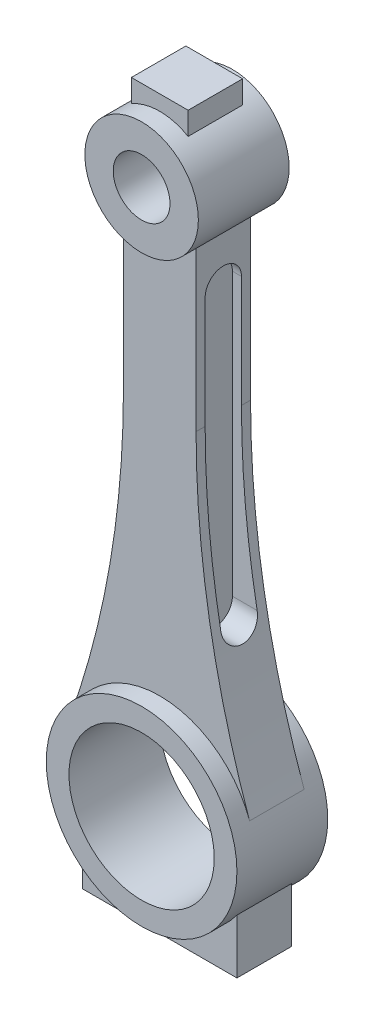
ISO-10303-21;
HEADER;
FILE_DESCRIPTION(('STEP AP214'),'2;1');
FILE_NAME('part.step','',(''),(''),'','','');
FILE_SCHEMA(('AUTOMOTIVE_DESIGN { 1 0 10303 214 1 1 1 1 }'));
ENDSEC;
DATA;
#1=APPLICATION_CONTEXT('core data for automotive mechanical design processes');
#2=APPLICATION_PROTOCOL_DEFINITION('international standard','automotive_design',2000,#1);
#3=PRODUCT_CONTEXT('',#1,'mechanical');
#4=PRODUCT('Part','Part','',(#3));
#5=PRODUCT_RELATED_PRODUCT_CATEGORY('part','',(#4));
#6=PRODUCT_DEFINITION_FORMATION('','',#4);
#7=PRODUCT_DEFINITION_CONTEXT('part definition',#1,'design');
#8=PRODUCT_DEFINITION('design','',#6,#7);
#9=PRODUCT_DEFINITION_SHAPE('','',#8);
#10=(LENGTH_UNIT() NAMED_UNIT(*) SI_UNIT(.MILLI.,.METRE.));
#11=(NAMED_UNIT(*) PLANE_ANGLE_UNIT() SI_UNIT($,.RADIAN.));
#12=(NAMED_UNIT(*) SI_UNIT($,.STERADIAN.) SOLID_ANGLE_UNIT());
#13=UNCERTAINTY_MEASURE_WITH_UNIT(LENGTH_MEASURE(1.E-05),#10,'distance_accuracy_value','');
#14=(GEOMETRIC_REPRESENTATION_CONTEXT(3) GLOBAL_UNCERTAINTY_ASSIGNED_CONTEXT((#13)) GLOBAL_UNIT_ASSIGNED_CONTEXT((#10,
#11,#12)) REPRESENTATION_CONTEXT('',''));
#15=CARTESIAN_POINT('',(0.,0.,0.));
#16=DIRECTION('',(0.,0.,1.));
#17=DIRECTION('',(1.,0.,0.));
#18=AXIS2_PLACEMENT_3D('',#15,#16,#17);
#19=CARTESIAN_POINT('',(212.132819979024,75.3953136438507,6.));
#20=DIRECTION('',(0.,0.,-1.));
#21=DIRECTION('',(-1.,0.,0.));
#22=AXIS2_PLACEMENT_3D('',#19,#20,#21);
#23=CYLINDRICAL_SURFACE('',#22,204.132819979024);
#24=CARTESIAN_POINT('',(11.4544735884215,38.,-4.00000000000001));
#25=CARTESIAN_POINT('',(11.4757515518411,37.8858086335559,-4.00000967356236));
#26=CARTESIAN_POINT('',(11.497127848932,37.7716411229782,-3.9951101211208));
#27=CARTESIAN_POINT('',(11.5399210356049,37.5441527728839,-3.97557755361704));
#28=CARTESIAN_POINT('',(11.5613379239584,37.4308319082381,-3.9609448286138));
#29=CARTESIAN_POINT('',(11.6040518019029,37.2058589467753,-3.92203609087538));
#30=CARTESIAN_POINT('',(11.6253488219803,37.0942064124742,-3.89776265395078));
#31=CARTESIAN_POINT('',(11.6676599337569,36.8733657612217,-3.83975872762631));
#32=CARTESIAN_POINT('',(11.6886740293759,36.7641776101131,-3.80602836938937));
#33=CARTESIAN_POINT('',(11.7510730473326,36.4413470108117,-3.69089420326938));
#34=CARTESIAN_POINT('',(11.7918289081029,36.2323636826891,-3.59553432969808));
#35=CARTESIAN_POINT('',(11.8702126062764,35.833491871712,-3.37027556179514));
#36=CARTESIAN_POINT('',(11.9078413597511,35.643597793309,-3.24038682968163));
#37=CARTESIAN_POINT('',(11.9784728244352,35.2894796680367,-2.950436910244));
#38=CARTESIAN_POINT('',(12.0115036519544,35.1250988255321,-2.79057453802656));
#39=CARTESIAN_POINT('',(12.0720036427705,34.8256035029566,-2.44449926104124));
#40=CARTESIAN_POINT('',(12.0994724370193,34.6904909648341,-2.25828460915734));
#41=CARTESIAN_POINT('',(12.1473413477104,34.4559602912754,-1.86832249559897));
#42=CARTESIAN_POINT('',(12.1678582991115,34.3559510460777,-1.66494499104501));
#43=CARTESIAN_POINT('',(12.201667760202,34.1915558050773,-1.24372237948288));
#44=CARTESIAN_POINT('',(12.2149615713728,34.1271633917176,-1.02587988675161));
#45=CARTESIAN_POINT('',(12.2336033492387,34.0369591960168,-0.586274812122707));
#46=CARTESIAN_POINT('',(12.2390950212482,34.0104496060439,-0.364661335561858));
#47=CARTESIAN_POINT('',(12.2423732155318,33.9946184843632,0.0799443502249368));
#48=CARTESIAN_POINT('',(12.2401601145853,34.0052951341722,0.302936491499029));
#49=CARTESIAN_POINT('',(12.2281765408432,34.0632127244266,0.74178192582431));
#50=CARTESIAN_POINT('',(12.2184766498272,34.1101121767816,0.957682365575698));
#51=CARTESIAN_POINT('',(12.1919895794175,34.2385791029979,1.37844153266758));
#52=CARTESIAN_POINT('',(12.1752023313576,34.3201469127454,1.58330015300714));
#53=CARTESIAN_POINT('',(12.1350793834177,34.5159552856904,1.977397761575));
#54=CARTESIAN_POINT('',(12.1117098081663,34.6303649264094,2.16654921549123));
#55=CARTESIAN_POINT('',(12.0593260749273,34.8882465100265,2.52297125984127));
#56=CARTESIAN_POINT('',(12.0303117725959,35.0317191961119,2.69024129055298));
#57=CARTESIAN_POINT('',(11.9671383735568,35.3461665633751,3.00114206510914));
#58=CARTESIAN_POINT('',(11.9329025496515,35.5175545383741,3.14433904981939));
#59=CARTESIAN_POINT('',(11.8607975408037,35.8812712267655,3.40006280722765));
#60=CARTESIAN_POINT('',(11.8229268395298,36.0736086840292,3.51257670427656));
#61=CARTESIAN_POINT('',(11.744011046999,36.4777513253325,3.70593438635491));
#62=CARTESIAN_POINT('',(11.7029182624971,36.6898643551292,3.78611370956408));
#63=CARTESIAN_POINT('',(11.6195357198389,37.1241795414682,3.90944320644274));
#64=CARTESIAN_POINT('',(11.5772477716993,37.3463667203578,3.95264656840454));
#65=CARTESIAN_POINT('',(11.5215540274853,37.6417241762258,3.98457340087694));
#66=CARTESIAN_POINT('',(11.5080944382149,37.713314753212,3.99036111817268));
#67=CARTESIAN_POINT('',(11.4812368188341,37.8565916807733,3.99806924003837));
#68=CARTESIAN_POINT('',(11.467838723541,37.9282776734255,3.99999606757804));
#69=CARTESIAN_POINT('',(11.4544735884215,38.,3.99999999999999));
#70=B_SPLINE_CURVE_WITH_KNOTS('',3,(#24,#25,#26,#27,#28,#29,#30,#31,#32,#33,#34,#35,#36,#37,#38,
#39,#40,#41,#42,#43,#44,#45,#46,#47,#48,#49,#50,#51,#52,#53,#54,#55,#56,#57,#58,#59,#60,#61,#62,
#63,#64,#65,#66,#67,#68,#69),.UNSPECIFIED.,.F.,.F.,(4,2,2,2,2,2,2,2,2,2,2,2,2,2,2,2,2,2,2,2,2,2,
4),(0.,0.348357600629778,0.696704820295753,1.044959030908,1.39320841164154,2.0894785742732,
2.78554404346983,3.47714614167072,4.1687941135383,4.84816302804556,5.52740949173436,
6.19397531687089,6.86050854603355,7.52083364695974,8.18116514562693,8.84495910470897,
9.50877004017901,10.1834922182609,10.8584970981523,11.546741507572,12.2339942357505,
12.4531452672714,12.6719314158043),.UNSPECIFIED.);
#71=CARTESIAN_POINT('',(11.4544735884215,38.,-4.00000000000001));
#72=VERTEX_POINT('',#71);
#73=CARTESIAN_POINT('',(11.4544735884215,38.,3.99999999999999));
#74=VERTEX_POINT('',#73);
#75=EDGE_CURVE('E481',#72,#74,#70,.T.);
#76=ORIENTED_EDGE('',*,*,#75,.T.);
#77=CARTESIAN_POINT('',(212.132819979024,75.3953136438507,3.99999999999999));
#78=DIRECTION('',(0.,0.,-1.));
#79=DIRECTION('',(0.,1.,0.));
#80=AXIS2_PLACEMENT_3D('',#77,#78,#79);
#81=CIRCLE('',#80,204.132819979024);
#82=CARTESIAN_POINT('',(7.99999999999999,75.3953136438507,4.));
#83=VERTEX_POINT('',#82);
#84=EDGE_CURVE('E279',#74,#83,#81,.T.);
#85=ORIENTED_EDGE('',*,*,#84,.T.);
#86=DIRECTION('',(0.,0.,-1.));
#87=VECTOR('',#86,1.);
#88=CARTESIAN_POINT('',(7.99999999999999,75.3953136438507,6.));
#89=LINE('',#88,#87);
#90=CARTESIAN_POINT('',(7.99999999999999,75.3953136438507,6.));
#91=VERTEX_POINT('',#90);
#92=EDGE_CURVE('E450',#91,#83,#89,.T.);
#93=ORIENTED_EDGE('',*,*,#92,.F.);
#94=CARTESIAN_POINT('',(212.132819979024,75.3953136438507,6.));
#95=DIRECTION('',(0.,0.,1.));
#96=DIRECTION('',(1.,0.,0.));
#97=AXIS2_PLACEMENT_3D('',#94,#95,#96);
#98=CIRCLE('',#97,204.132819979024);
#99=CARTESIAN_POINT('',(19.7873824881444,7.03274443356765,6.));
#100=VERTEX_POINT('',#99);
#101=EDGE_CURVE('E386',#91,#100,#98,.T.);
#102=ORIENTED_EDGE('',*,*,#101,.T.);
#103=DIRECTION('',(0.,0.,-1.));
#104=VECTOR('',#103,1.);
#105=CARTESIAN_POINT('',(19.7873824881444,7.03274443356765,6.));
#106=LINE('',#105,#104);
#107=CARTESIAN_POINT('',(19.7873824881444,7.03274443356765,-6.));
#108=VERTEX_POINT('',#107);
#109=EDGE_CURVE('E408',#100,#108,#106,.T.);
#110=ORIENTED_EDGE('',*,*,#109,.T.);
#111=CARTESIAN_POINT('',(212.132819979024,75.3953136438507,-6.));
#112=DIRECTION('',(0.,0.,1.));
#113=DIRECTION('',(1.,0.,0.));
#114=AXIS2_PLACEMENT_3D('',#111,#112,#113);
#115=CIRCLE('',#114,204.132819979024);
#116=CARTESIAN_POINT('',(7.99999999999999,75.3953136438507,-6.));
#117=VERTEX_POINT('',#116);
#118=EDGE_CURVE('E379',#117,#108,#115,.T.);
#119=ORIENTED_EDGE('',*,*,#118,.F.);
#120=CARTESIAN_POINT('',(7.99999999999999,75.3953136438507,-4.00000000000001));
#121=VERTEX_POINT('',#120);
#122=EDGE_CURVE('E449',#121,#117,#89,.T.);
#123=ORIENTED_EDGE('',*,*,#122,.F.);
#124=CARTESIAN_POINT('',(212.132819979024,75.3953136438507,-4.00000000000001));
#125=DIRECTION('',(0.,0.,-1.));
#126=DIRECTION('',(0.,1.,0.));
#127=AXIS2_PLACEMENT_3D('',#124,#125,#126);
#128=CIRCLE('',#127,204.132819979024);
#129=EDGE_CURVE('E276',#72,#121,#128,.T.);
#130=ORIENTED_EDGE('',*,*,#129,.F.);
#131=EDGE_LOOP('',(#76,#85,#93,#102,#110,#119,#123,#130));
#132=FACE_BOUND('',#131,.T.);
#133=ADVANCED_FACE('F43',(#132),#23,.F.);
#134=CARTESIAN_POINT('',(0.,0.,10.));
#135=DIRECTION('',(0.,0.,-1.));
#136=DIRECTION('',(-1.,0.,0.));
#137=AXIS2_PLACEMENT_3D('',#134,#135,#136);
#138=CYLINDRICAL_SURFACE('',#137,16.);
#139=CARTESIAN_POINT('',(0.,0.,10.));
#140=DIRECTION('',(0.,0.,1.));
#141=DIRECTION('',(1.,0.,0.));
#142=AXIS2_PLACEMENT_3D('',#139,#140,#141);
#143=CIRCLE('',#142,16.);
#144=CARTESIAN_POINT('',(16.,0.,10.));
#145=VERTEX_POINT('',#144);
#146=EDGE_CURVE('E455',#145,#145,#143,.T.);
#147=ORIENTED_EDGE('',*,*,#146,.T.);
#148=EDGE_LOOP('',(#147));
#149=FACE_BOUND('',#148,.T.);
#150=CARTESIAN_POINT('',(0.,0.,-10.));
#151=DIRECTION('',(0.,0.,1.));
#152=DIRECTION('',(1.,0.,0.));
#153=AXIS2_PLACEMENT_3D('',#150,#151,#152);
#154=CIRCLE('',#153,16.);
#155=CARTESIAN_POINT('',(16.,0.,-10.));
#156=VERTEX_POINT('',#155);
#157=EDGE_CURVE('E454',#156,#156,#154,.T.);
#158=ORIENTED_EDGE('',*,*,#157,.F.);
#159=EDGE_LOOP('',(#158));
#160=FACE_BOUND('',#159,.T.);
#161=ADVANCED_FACE('F45',(#149,#160),#138,.F.);
#162=CARTESIAN_POINT('',(0.,0.,10.));
#163=DIRECTION('',(0.,0.,-1.));
#164=DIRECTION('',(-1.,0.,0.));
#165=AXIS2_PLACEMENT_3D('',#162,#163,#164);
#166=CYLINDRICAL_SURFACE('',#165,21.);
#167=DIRECTION('',(0.,0.,-1.));
#168=VECTOR('',#167,1.);
#169=CARTESIAN_POINT('',(-17.,-12.328828005938,6.));
#170=LINE('',#169,#168);
#171=CARTESIAN_POINT('',(-17.,-12.3288280059379,6.));
#172=VERTEX_POINT('',#171);
#173=CARTESIAN_POINT('',(-17.,-12.328828005938,-6.));
#174=VERTEX_POINT('',#173);
#175=EDGE_CURVE('E321',#172,#174,#170,.T.);
#176=ORIENTED_EDGE('',*,*,#175,.F.);
#177=CARTESIAN_POINT('',(0.,0.,6.));
#178=DIRECTION('',(0.,0.,1.));
#179=DIRECTION('',(1.,0.,0.));
#180=AXIS2_PLACEMENT_3D('',#177,#178,#179);
#181=CIRCLE('',#180,21.);
#182=CARTESIAN_POINT('',(17.,-12.3288280059379,6.));
#183=VERTEX_POINT('',#182);
#184=EDGE_CURVE('E284',#172,#183,#181,.T.);
#185=ORIENTED_EDGE('',*,*,#184,.T.);
#186=DIRECTION('',(0.,0.,-1.));
#187=VECTOR('',#186,1.);
#188=CARTESIAN_POINT('',(17.,-12.3288280059379,6.));
#189=LINE('',#188,#187);
#190=CARTESIAN_POINT('',(17.,-12.3288280059379,-6.));
#191=VERTEX_POINT('',#190);
#192=EDGE_CURVE('E298',#183,#191,#189,.T.);
#193=ORIENTED_EDGE('',*,*,#192,.T.);
#194=CARTESIAN_POINT('',(0.,0.,-6.));
#195=DIRECTION('',(0.,0.,1.));
#196=DIRECTION('',(1.,0.,0.));
#197=AXIS2_PLACEMENT_3D('',#194,#195,#196);
#198=CIRCLE('',#197,21.);
#199=EDGE_CURVE('E283',#174,#191,#198,.T.);
#200=ORIENTED_EDGE('',*,*,#199,.F.);
#201=EDGE_LOOP('',(#176,#185,#193,#200));
#202=FACE_BOUND('',#201,.T.);
#203=ORIENTED_EDGE('',*,*,#109,.F.);
#204=CARTESIAN_POINT('',(0.,0.,6.));
#205=DIRECTION('',(0.,0.,1.));
#206=DIRECTION('',(1.,0.,0.));
#207=AXIS2_PLACEMENT_3D('',#204,#205,#206);
#208=CIRCLE('',#207,21.);
#209=CARTESIAN_POINT('',(-19.7873824881444,7.03274443356765,6.));
#210=VERTEX_POINT('',#209);
#211=EDGE_CURVE('E405',#100,#210,#208,.T.);
#212=ORIENTED_EDGE('',*,*,#211,.T.);
#213=DIRECTION('',(0.,0.,-1.));
#214=VECTOR('',#213,1.);
#215=CARTESIAN_POINT('',(-19.7873824881444,7.03274443356764,6.));
#216=LINE('',#215,#214);
#217=CARTESIAN_POINT('',(-19.7873824881444,7.03274443356764,-6.));
#218=VERTEX_POINT('',#217);
#219=EDGE_CURVE('E434',#210,#218,#216,.T.);
#220=ORIENTED_EDGE('',*,*,#219,.T.);
#221=CARTESIAN_POINT('',(0.,0.,-6.));
#222=DIRECTION('',(0.,0.,1.));
#223=DIRECTION('',(1.,0.,0.));
#224=AXIS2_PLACEMENT_3D('',#221,#222,#223);
#225=CIRCLE('',#224,21.);
#226=EDGE_CURVE('E391',#108,#218,#225,.T.);
#227=ORIENTED_EDGE('',*,*,#226,.F.);
#228=EDGE_LOOP('',(#203,#212,#220,#227));
#229=FACE_BOUND('',#228,.T.);
#230=CARTESIAN_POINT('',(0.,0.,10.));
#231=DIRECTION('',(0.,0.,1.));
#232=DIRECTION('',(1.,0.,0.));
#233=AXIS2_PLACEMENT_3D('',#230,#231,#232);
#234=CIRCLE('',#233,21.);
#235=CARTESIAN_POINT('',(21.,0.,10.));
#236=VERTEX_POINT('',#235);
#237=EDGE_CURVE('E459',#236,#236,#234,.T.);
#238=ORIENTED_EDGE('',*,*,#237,.F.);
#239=EDGE_LOOP('',(#238));
#240=FACE_BOUND('',#239,.T.);
#241=CARTESIAN_POINT('',(0.,0.,-10.));
#242=DIRECTION('',(0.,0.,1.));
#243=DIRECTION('',(1.,0.,0.));
#244=AXIS2_PLACEMENT_3D('',#241,#242,#243);
#245=CIRCLE('',#244,21.);
#246=CARTESIAN_POINT('',(21.,0.,-10.));
#247=VERTEX_POINT('',#246);
#248=EDGE_CURVE('E460',#247,#247,#245,.T.);
#249=ORIENTED_EDGE('',*,*,#248,.T.);
#250=EDGE_LOOP('',(#249));
#251=FACE_BOUND('',#250,.T.);
#252=ADVANCED_FACE('F600',(#202,#229,#240,#251),#166,.T.);
#253=CARTESIAN_POINT('',(0.,0.,10.));
#254=DIRECTION('',(0.,0.,1.));
#255=DIRECTION('',(1.,0.,0.));
#256=AXIS2_PLACEMENT_3D('',#253,#254,#255);
#257=PLANE('',#256);
#258=ORIENTED_EDGE('',*,*,#146,.F.);
#259=EDGE_LOOP('',(#258));
#260=FACE_BOUND('',#259,.T.);
#261=ORIENTED_EDGE('',*,*,#237,.T.);
#262=EDGE_LOOP('',(#261));
#263=FACE_BOUND('',#262,.T.);
#264=ADVANCED_FACE('F592',(#260,#263),#257,.T.);
#265=CARTESIAN_POINT('',(0.,0.,-10.));
#266=DIRECTION('',(0.,0.,1.));
#267=DIRECTION('',(1.,0.,0.));
#268=AXIS2_PLACEMENT_3D('',#265,#266,#267);
#269=PLANE('',#268);
#270=ORIENTED_EDGE('',*,*,#157,.T.);
#271=EDGE_LOOP('',(#270));
#272=FACE_BOUND('',#271,.T.);
#273=ORIENTED_EDGE('',*,*,#248,.F.);
#274=EDGE_LOOP('',(#273));
#275=FACE_BOUND('',#274,.T.);
#276=ADVANCED_FACE('F587',(#272,#275),#269,.F.);
#277=CARTESIAN_POINT('',(7.99999999999998,0.,6.));
#278=DIRECTION('',(1.,0.,0.));
#279=DIRECTION('',(0.,1.,0.));
#280=AXIS2_PLACEMENT_3D('',#277,#278,#279);
#281=PLANE('',#280);
#282=ORIENTED_EDGE('',*,*,#92,.T.);
#283=DIRECTION('',(0.,1.,0.));
#284=VECTOR('',#283,1.);
#285=CARTESIAN_POINT('',(7.99999999999998,0.,3.99999999999999));
#286=LINE('',#285,#284);
#287=CARTESIAN_POINT('',(8.,100.,4.));
#288=VERTEX_POINT('',#287);
#289=EDGE_CURVE('E477',#83,#288,#286,.T.);
#290=ORIENTED_EDGE('',*,*,#289,.T.);
#291=CARTESIAN_POINT('',(8.,100.,0.));
#292=DIRECTION('',(1.,0.,0.));
#293=DIRECTION('',(0.,1.,0.));
#294=AXIS2_PLACEMENT_3D('',#291,#292,#293);
#295=CIRCLE('',#294,4.);
#296=CARTESIAN_POINT('',(8.,100.,-4.));
#297=VERTEX_POINT('',#296);
#298=EDGE_CURVE('E464',#288,#297,#295,.F.);
#299=ORIENTED_EDGE('',*,*,#298,.T.);
#300=DIRECTION('',(0.,1.,0.));
#301=VECTOR('',#300,1.);
#302=CARTESIAN_POINT('',(7.99999999999998,0.,-4.00000000000002));
#303=LINE('',#302,#301);
#304=EDGE_CURVE('E474',#121,#297,#303,.T.);
#305=ORIENTED_EDGE('',*,*,#304,.F.);
#306=ORIENTED_EDGE('',*,*,#122,.T.);
#307=DIRECTION('',(0.,-1.,0.));
#308=VECTOR('',#307,1.);
#309=CARTESIAN_POINT('',(7.99999999999998,0.,-6.));
#310=LINE('',#309,#308);
#311=CARTESIAN_POINT('',(8.,110.395313643851,-6.));
#312=VERTEX_POINT('',#311);
#313=EDGE_CURVE('E412',#312,#117,#310,.T.);
#314=ORIENTED_EDGE('',*,*,#313,.F.);
#315=DIRECTION('',(0.,0.,-1.));
#316=VECTOR('',#315,1.);
#317=CARTESIAN_POINT('',(8.,110.395313643851,6.));
#318=LINE('',#317,#316);
#319=CARTESIAN_POINT('',(8.,110.395313643851,6.));
#320=VERTEX_POINT('',#319);
#321=EDGE_CURVE('E446',#320,#312,#318,.T.);
#322=ORIENTED_EDGE('',*,*,#321,.F.);
#323=DIRECTION('',(0.,-1.,0.));
#324=VECTOR('',#323,1.);
#325=CARTESIAN_POINT('',(7.99999999999998,0.,6.));
#326=LINE('',#325,#324);
#327=EDGE_CURVE('E390',#320,#91,#326,.T.);
#328=ORIENTED_EDGE('',*,*,#327,.T.);
#329=EDGE_LOOP('',(#282,#290,#299,#305,#306,#314,#322,#328));
#330=FACE_BOUND('',#329,.T.);
#331=ADVANCED_FACE('F584',(#330),#281,.T.);
#332=CARTESIAN_POINT('',(-7.99999999999998,0.,6.));
#333=DIRECTION('',(1.,0.,0.));
#334=DIRECTION('',(0.,1.,0.));
#335=AXIS2_PLACEMENT_3D('',#332,#333,#334);
#336=PLANE('',#335);
#337=CARTESIAN_POINT('',(-8.,100.,0.));
#338=DIRECTION('',(1.,0.,0.));
#339=DIRECTION('',(0.,1.,0.));
#340=AXIS2_PLACEMENT_3D('',#337,#338,#339);
#341=CIRCLE('',#340,4.);
#342=CARTESIAN_POINT('',(-8.,100.,-4.));
#343=VERTEX_POINT('',#342);
#344=CARTESIAN_POINT('',(-8.,100.,4.));
#345=VERTEX_POINT('',#344);
#346=EDGE_CURVE('E11',#343,#345,#341,.T.);
#347=ORIENTED_EDGE('',*,*,#346,.T.);
#348=DIRECTION('',(0.,-1.,0.));
#349=VECTOR('',#348,1.);
#350=CARTESIAN_POINT('',(-7.99999999999998,0.,3.99999999999999));
#351=LINE('',#350,#349);
#352=CARTESIAN_POINT('',(-8.00000000000001,75.3953136438507,3.99999999999999));
#353=VERTEX_POINT('',#352);
#354=EDGE_CURVE('E212',#345,#353,#351,.T.);
#355=ORIENTED_EDGE('',*,*,#354,.T.);
#356=DIRECTION('',(0.,0.,-1.));
#357=VECTOR('',#356,1.);
#358=CARTESIAN_POINT('',(-7.99999999999999,75.3953136438507,6.));
#359=LINE('',#358,#357);
#360=CARTESIAN_POINT('',(-7.99999999999999,75.3953136438507,6.));
#361=VERTEX_POINT('',#360);
#362=EDGE_CURVE('E438',#361,#353,#359,.T.);
#363=ORIENTED_EDGE('',*,*,#362,.F.);
#364=DIRECTION('',(0.,-1.,0.));
#365=VECTOR('',#364,1.);
#366=CARTESIAN_POINT('',(-7.99999999999998,0.,6.));
#367=LINE('',#366,#365);
#368=CARTESIAN_POINT('',(-8.,110.395313643851,6.));
#369=VERTEX_POINT('',#368);
#370=EDGE_CURVE('E398',#369,#361,#367,.T.);
#371=ORIENTED_EDGE('',*,*,#370,.F.);
#372=DIRECTION('',(0.,0.,-1.));
#373=VECTOR('',#372,1.);
#374=CARTESIAN_POINT('',(-8.,110.395313643851,6.));
#375=LINE('',#374,#373);
#376=CARTESIAN_POINT('',(-8.,110.395313643851,-6.));
#377=VERTEX_POINT('',#376);
#378=EDGE_CURVE('E442',#369,#377,#375,.T.);
#379=ORIENTED_EDGE('',*,*,#378,.T.);
#380=DIRECTION('',(0.,-1.,0.));
#381=VECTOR('',#380,1.);
#382=CARTESIAN_POINT('',(-7.99999999999998,0.,-6.));
#383=LINE('',#382,#381);
#384=CARTESIAN_POINT('',(-7.99999999999999,75.3953136438507,-6.));
#385=VERTEX_POINT('',#384);
#386=EDGE_CURVE('E420',#377,#385,#383,.T.);
#387=ORIENTED_EDGE('',*,*,#386,.T.);
#388=CARTESIAN_POINT('',(-8.00000000000001,75.3953136438507,-4.00000000000001));
#389=VERTEX_POINT('',#388);
#390=EDGE_CURVE('E437',#389,#385,#359,.T.);
#391=ORIENTED_EDGE('',*,*,#390,.F.);
#392=DIRECTION('',(0.,-1.,0.));
#393=VECTOR('',#392,1.);
#394=CARTESIAN_POINT('',(-7.99999999999998,0.,-4.00000000000002));
#395=LINE('',#394,#393);
#396=EDGE_CURVE('E216',#343,#389,#395,.T.);
#397=ORIENTED_EDGE('',*,*,#396,.F.);
#398=EDGE_LOOP('',(#347,#355,#363,#371,#379,#387,#391,#397));
#399=FACE_BOUND('',#398,.T.);
#400=ADVANCED_FACE('F581',(#399),#336,.F.);
#401=CARTESIAN_POINT('',(-212.132819979024,75.3953136438507,6.));
#402=DIRECTION('',(0.,0.,-1.));
#403=DIRECTION('',(-1.,0.,0.));
#404=AXIS2_PLACEMENT_3D('',#401,#402,#403);
#405=CYLINDRICAL_SURFACE('',#404,204.132819979024);
#406=ORIENTED_EDGE('',*,*,#362,.T.);
#407=CARTESIAN_POINT('',(-212.132819979024,75.3953136438507,3.99999999999999));
#408=DIRECTION('',(0.,0.,1.));
#409=DIRECTION('',(0.,-1.,0.));
#410=AXIS2_PLACEMENT_3D('',#407,#408,#409);
#411=CIRCLE('',#410,204.132819979024);
#412=CARTESIAN_POINT('',(-11.4544735884215,38.,3.99999999999999));
#413=VERTEX_POINT('',#412);
#414=EDGE_CURVE('E52',#353,#413,#411,.F.);
#415=ORIENTED_EDGE('',*,*,#414,.T.);
#416=CARTESIAN_POINT('',(-11.4544735884215,38.,3.99999999999999));
#417=CARTESIAN_POINT('',(-11.4757515518411,37.8858086335559,4.00000967356234));
#418=CARTESIAN_POINT('',(-11.4971278489319,37.7716411229782,3.99511012112078));
#419=CARTESIAN_POINT('',(-11.5399210356049,37.5441527728839,3.97557755361703));
#420=CARTESIAN_POINT('',(-11.5613379239584,37.4308319082381,3.96094482861378));
#421=CARTESIAN_POINT('',(-11.6040518019029,37.2058589467753,3.92203609087536));
#422=CARTESIAN_POINT('',(-11.6253488219803,37.0942064124742,3.89776265395076));
#423=CARTESIAN_POINT('',(-11.6676599337569,36.8733657612217,3.83975872762629));
#424=CARTESIAN_POINT('',(-11.6886740293759,36.7641776101131,3.80602836938935));
#425=CARTESIAN_POINT('',(-11.7510730473326,36.4413470108117,3.69089420326936));
#426=CARTESIAN_POINT('',(-11.7918289081029,36.232363682689,3.59553432969805));
#427=CARTESIAN_POINT('',(-11.8702126062764,35.833491871712,3.37027556179511));
#428=CARTESIAN_POINT('',(-11.9078413597511,35.643597793309,3.24038682968161));
#429=CARTESIAN_POINT('',(-11.9784728244352,35.2894796680367,2.95043691024398));
#430=CARTESIAN_POINT('',(-12.0115036519544,35.1250988255321,2.79057453802652));
#431=CARTESIAN_POINT('',(-12.0720036427705,34.8256035029566,2.44449926104121));
#432=CARTESIAN_POINT('',(-12.0994724370193,34.6904909648341,2.2582846091573));
#433=CARTESIAN_POINT('',(-12.1473413477104,34.4559602912754,1.86832249559894));
#434=CARTESIAN_POINT('',(-12.1678582991115,34.3559510460777,1.66494499104498));
#435=CARTESIAN_POINT('',(-12.201667760202,34.1915558050773,1.24372237948285));
#436=CARTESIAN_POINT('',(-12.2149615713728,34.1271633917176,1.02587988675158));
#437=CARTESIAN_POINT('',(-12.2336033492388,34.0369591960168,0.586274812122678));
#438=CARTESIAN_POINT('',(-12.2390950212482,34.0104496060439,0.364661335561828));
#439=CARTESIAN_POINT('',(-12.2423732155319,33.9946184843632,-0.07994435022497));
#440=CARTESIAN_POINT('',(-12.2401601145853,34.0052951341722,-0.302936491499064));
#441=CARTESIAN_POINT('',(-12.2281765408432,34.0632127244266,-0.741781925824345));
#442=CARTESIAN_POINT('',(-12.2184766498272,34.1101121767816,-0.957682365575733));
#443=CARTESIAN_POINT('',(-12.1919895794175,34.2385791029979,-1.37844153266761));
#444=CARTESIAN_POINT('',(-12.1752023313576,34.3201469127454,-1.58330015300717));
#445=CARTESIAN_POINT('',(-12.1350793834177,34.5159552856904,-1.97739776157503));
#446=CARTESIAN_POINT('',(-12.1117098081663,34.6303649264094,-2.16654921549126));
#447=CARTESIAN_POINT('',(-12.0593260749273,34.8882465100265,-2.5229712598413));
#448=CARTESIAN_POINT('',(-12.0303117725959,35.0317191961119,-2.69024129055301));
#449=CARTESIAN_POINT('',(-11.9671383735568,35.3461665633751,-3.00114206510916));
#450=CARTESIAN_POINT('',(-11.9329025496515,35.5175545383741,-3.14433904981941));
#451=CARTESIAN_POINT('',(-11.8607975408037,35.8812712267655,-3.40006280722767));
#452=CARTESIAN_POINT('',(-11.8229268395298,36.0736086840292,-3.51257670427658));
#453=CARTESIAN_POINT('',(-11.744011046999,36.4777513253325,-3.70593438635494));
#454=CARTESIAN_POINT('',(-11.7029182624971,36.6898643551292,-3.7861137095641));
#455=CARTESIAN_POINT('',(-11.6195357198389,37.1241795414682,-3.90944320644276));
#456=CARTESIAN_POINT('',(-11.5772477716992,37.3463667203578,-3.95264656840456));
#457=CARTESIAN_POINT('',(-11.5215540274852,37.6417241762258,-3.98457340087696));
#458=CARTESIAN_POINT('',(-11.5080944382149,37.713314753212,-3.9903611181727));
#459=CARTESIAN_POINT('',(-11.4812368188341,37.8565916807733,-3.99806924003839));
#460=CARTESIAN_POINT('',(-11.467838723541,37.9282776734255,-3.99999606757806));
#461=CARTESIAN_POINT('',(-11.4544735884215,38.,-4.00000000000001));
#462=B_SPLINE_CURVE_WITH_KNOTS('',3,(#416,#417,#418,#419,#420,#421,#422,#423,#424,#425,#426,
#427,#428,#429,#430,#431,#432,#433,#434,#435,#436,#437,#438,#439,#440,#441,#442,#443,#444,#445,
#446,#447,#448,#449,#450,#451,#452,#453,#454,#455,#456,#457,#458,#459,#460,#461),.UNSPECIFIED.,
.F.,.F.,(4,2,2,2,2,2,2,2,2,2,2,2,2,2,2,2,2,2,2,2,2,2,4),(0.,0.348357600629781,0.696704820295756,
1.04495903090802,1.39320841164156,2.08947857427322,2.78554404346985,3.47714614167074,
4.16879411353832,4.84816302804557,5.52740949173437,6.1939753168709,6.86050854603357,
7.52083364695976,8.18116514562695,8.844959104709,9.50877004017902,10.1834922182609,
10.8584970981523,11.546741507572,12.2339942357506,12.4531452672714,12.6719314158043),.UNSPECIFIED.);
#463=CARTESIAN_POINT('',(-11.4544735884215,38.,-4.00000000000001));
#464=VERTEX_POINT('',#463);
#465=EDGE_CURVE('E491',#413,#464,#462,.T.);
#466=ORIENTED_EDGE('',*,*,#465,.T.);
#467=CARTESIAN_POINT('',(-212.132819979024,75.3953136438507,-4.00000000000001));
#468=DIRECTION('',(0.,0.,1.));
#469=DIRECTION('',(0.,-1.,0.));
#470=AXIS2_PLACEMENT_3D('',#467,#468,#469);
#471=CIRCLE('',#470,204.132819979024);
#472=EDGE_CURVE('E632',#389,#464,#471,.F.);
#473=ORIENTED_EDGE('',*,*,#472,.F.);
#474=ORIENTED_EDGE('',*,*,#390,.T.);
#475=CARTESIAN_POINT('',(-212.132819979024,75.3953136438507,-6.));
#476=DIRECTION('',(0.,0.,1.));
#477=DIRECTION('',(1.,0.,0.));
#478=AXIS2_PLACEMENT_3D('',#475,#476,#477);
#479=CIRCLE('',#478,204.132819979024);
#480=EDGE_CURVE('E424',#385,#218,#479,.F.);
#481=ORIENTED_EDGE('',*,*,#480,.T.);
#482=ORIENTED_EDGE('',*,*,#219,.F.);
#483=CARTESIAN_POINT('',(-212.132819979024,75.3953136438507,6.));
#484=DIRECTION('',(0.,0.,1.));
#485=DIRECTION('',(1.,0.,0.));
#486=AXIS2_PLACEMENT_3D('',#483,#484,#485);
#487=CIRCLE('',#486,204.132819979024);
#488=EDGE_CURVE('E401',#361,#210,#487,.F.);
#489=ORIENTED_EDGE('',*,*,#488,.F.);
#490=EDGE_LOOP('',(#406,#415,#466,#473,#474,#481,#482,#489));
#491=FACE_BOUND('',#490,.T.);
#492=ADVANCED_FACE('F574',(#491),#405,.F.);
#493=CARTESIAN_POINT('',(0.,0.,6.));
#494=DIRECTION('',(0.,0.,1.));
#495=DIRECTION('',(1.,0.,0.));
#496=AXIS2_PLACEMENT_3D('',#493,#494,#495);
#497=PLANE('',#496);
#498=ORIENTED_EDGE('',*,*,#101,.F.);
#499=ORIENTED_EDGE('',*,*,#327,.F.);
#500=CARTESIAN_POINT('',(0.,120.,6.));
#501=DIRECTION('',(0.,0.,1.));
#502=DIRECTION('',(1.,0.,0.));
#503=AXIS2_PLACEMENT_3D('',#500,#501,#502);
#504=CIRCLE('',#503,12.5);
#505=EDGE_CURVE('E395',#369,#320,#504,.T.);
#506=ORIENTED_EDGE('',*,*,#505,.F.);
#507=ORIENTED_EDGE('',*,*,#370,.T.);
#508=ORIENTED_EDGE('',*,*,#488,.T.);
#509=ORIENTED_EDGE('',*,*,#211,.F.);
#510=EDGE_LOOP('',(#498,#499,#506,#507,#508,#509));
#511=FACE_BOUND('',#510,.T.);
#512=ADVANCED_FACE('F571',(#511),#497,.T.);
#513=CARTESIAN_POINT('',(0.,0.,-6.));
#514=DIRECTION('',(0.,0.,1.));
#515=DIRECTION('',(1.,0.,0.));
#516=AXIS2_PLACEMENT_3D('',#513,#514,#515);
#517=PLANE('',#516);
#518=ORIENTED_EDGE('',*,*,#118,.T.);
#519=ORIENTED_EDGE('',*,*,#226,.T.);
#520=ORIENTED_EDGE('',*,*,#480,.F.);
#521=ORIENTED_EDGE('',*,*,#386,.F.);
#522=CARTESIAN_POINT('',(0.,120.,-6.));
#523=DIRECTION('',(0.,0.,1.));
#524=DIRECTION('',(1.,0.,0.));
#525=AXIS2_PLACEMENT_3D('',#522,#523,#524);
#526=CIRCLE('',#525,12.5);
#527=EDGE_CURVE('E416',#377,#312,#526,.T.);
#528=ORIENTED_EDGE('',*,*,#527,.T.);
#529=ORIENTED_EDGE('',*,*,#313,.T.);
#530=EDGE_LOOP('',(#518,#519,#520,#521,#528,#529));
#531=FACE_BOUND('',#530,.T.);
#532=ADVANCED_FACE('F569',(#531),#517,.F.);
#533=CARTESIAN_POINT('',(0.,120.,10.));
#534=DIRECTION('',(0.,0.,-1.));
#535=DIRECTION('',(-1.,0.,0.));
#536=AXIS2_PLACEMENT_3D('',#533,#534,#535);
#537=CYLINDRICAL_SURFACE('',#536,6.25);
#538=CARTESIAN_POINT('',(0.,120.,10.));
#539=DIRECTION('',(0.,0.,1.));
#540=DIRECTION('',(1.,0.,0.));
#541=AXIS2_PLACEMENT_3D('',#538,#539,#540);
#542=CIRCLE('',#541,6.25);
#543=CARTESIAN_POINT('',(6.25,120.,10.));
#544=VERTEX_POINT('',#543);
#545=EDGE_CURVE('E370',#544,#544,#542,.T.);
#546=ORIENTED_EDGE('',*,*,#545,.T.);
#547=EDGE_LOOP('',(#546));
#548=FACE_BOUND('',#547,.T.);
#549=CARTESIAN_POINT('',(0.,120.,-10.));
#550=DIRECTION('',(0.,0.,1.));
#551=DIRECTION('',(1.,0.,0.));
#552=AXIS2_PLACEMENT_3D('',#549,#550,#551);
#553=CIRCLE('',#552,6.25);
#554=CARTESIAN_POINT('',(6.25,120.,-10.));
#555=VERTEX_POINT('',#554);
#556=EDGE_CURVE('E369',#555,#555,#553,.T.);
#557=ORIENTED_EDGE('',*,*,#556,.F.);
#558=EDGE_LOOP('',(#557));
#559=FACE_BOUND('',#558,.T.);
#560=ADVANCED_FACE('F565',(#548,#559),#537,.F.);
#561=CARTESIAN_POINT('',(0.,120.,10.));
#562=DIRECTION('',(0.,0.,-1.));
#563=DIRECTION('',(-1.,0.,0.));
#564=AXIS2_PLACEMENT_3D('',#561,#562,#563);
#565=CYLINDRICAL_SURFACE('',#564,12.5);
#566=DIRECTION('',(0.,0.,-1.));
#567=VECTOR('',#566,1.);
#568=CARTESIAN_POINT('',(6.25,130.825317547305,6.));
#569=LINE('',#568,#567);
#570=CARTESIAN_POINT('',(6.25,130.825317547305,6.));
#571=VERTEX_POINT('',#570);
#572=CARTESIAN_POINT('',(6.24999999999999,130.825317547305,-6.));
#573=VERTEX_POINT('',#572);
#574=EDGE_CURVE('E365',#571,#573,#569,.T.);
#575=ORIENTED_EDGE('',*,*,#574,.F.);
#576=CARTESIAN_POINT('',(0.,120.,6.));
#577=DIRECTION('',(0.,0.,1.));
#578=DIRECTION('',(1.,0.,0.));
#579=AXIS2_PLACEMENT_3D('',#576,#577,#578);
#580=CIRCLE('',#579,12.5);
#581=CARTESIAN_POINT('',(-6.25,130.825317547305,6.));
#582=VERTEX_POINT('',#581);
#583=EDGE_CURVE('E326',#571,#582,#580,.T.);
#584=ORIENTED_EDGE('',*,*,#583,.T.);
#585=DIRECTION('',(0.,0.,-1.));
#586=VECTOR('',#585,1.);
#587=CARTESIAN_POINT('',(-6.25,130.825317547305,6.));
#588=LINE('',#587,#586);
#589=CARTESIAN_POINT('',(-6.25,130.825317547305,-6.));
#590=VERTEX_POINT('',#589);
#591=EDGE_CURVE('E342',#582,#590,#588,.T.);
#592=ORIENTED_EDGE('',*,*,#591,.T.);
#593=CARTESIAN_POINT('',(0.,120.,-6.));
#594=DIRECTION('',(0.,0.,1.));
#595=DIRECTION('',(1.,0.,0.));
#596=AXIS2_PLACEMENT_3D('',#593,#594,#595);
#597=CIRCLE('',#596,12.5);
#598=EDGE_CURVE('E325',#573,#590,#597,.T.);
#599=ORIENTED_EDGE('',*,*,#598,.F.);
#600=EDGE_LOOP('',(#575,#584,#592,#599));
#601=FACE_BOUND('',#600,.T.);
#602=ORIENTED_EDGE('',*,*,#505,.T.);
#603=ORIENTED_EDGE('',*,*,#321,.T.);
#604=ORIENTED_EDGE('',*,*,#527,.F.);
#605=ORIENTED_EDGE('',*,*,#378,.F.);
#606=EDGE_LOOP('',(#602,#603,#604,#605));
#607=FACE_BOUND('',#606,.T.);
#608=CARTESIAN_POINT('',(0.,120.,10.));
#609=DIRECTION('',(0.,0.,1.));
#610=DIRECTION('',(1.,0.,0.));
#611=AXIS2_PLACEMENT_3D('',#608,#609,#610);
#612=CIRCLE('',#611,12.5);
#613=CARTESIAN_POINT('',(12.5,120.,10.));
#614=VERTEX_POINT('',#613);
#615=EDGE_CURVE('E374',#614,#614,#612,.T.);
#616=ORIENTED_EDGE('',*,*,#615,.F.);
#617=EDGE_LOOP('',(#616));
#618=FACE_BOUND('',#617,.T.);
#619=CARTESIAN_POINT('',(0.,120.,-10.));
#620=DIRECTION('',(0.,0.,1.));
#621=DIRECTION('',(1.,0.,0.));
#622=AXIS2_PLACEMENT_3D('',#619,#620,#621);
#623=CIRCLE('',#622,12.5);
#624=CARTESIAN_POINT('',(12.5,120.,-10.));
#625=VERTEX_POINT('',#624);
#626=EDGE_CURVE('E375',#625,#625,#623,.T.);
#627=ORIENTED_EDGE('',*,*,#626,.T.);
#628=EDGE_LOOP('',(#627));
#629=FACE_BOUND('',#628,.T.);
#630=ADVANCED_FACE('F558',(#601,#607,#618,#629),#565,.T.);
#631=CARTESIAN_POINT('',(0.,0.,10.));
#632=DIRECTION('',(0.,0.,1.));
#633=DIRECTION('',(1.,0.,0.));
#634=AXIS2_PLACEMENT_3D('',#631,#632,#633);
#635=PLANE('',#634);
#636=ORIENTED_EDGE('',*,*,#545,.F.);
#637=EDGE_LOOP('',(#636));
#638=FACE_BOUND('',#637,.T.);
#639=ORIENTED_EDGE('',*,*,#615,.T.);
#640=EDGE_LOOP('',(#639));
#641=FACE_BOUND('',#640,.T.);
#642=ADVANCED_FACE('F555',(#638,#641),#635,.T.);
#643=CARTESIAN_POINT('',(0.,0.,-10.));
#644=DIRECTION('',(0.,0.,1.));
#645=DIRECTION('',(1.,0.,0.));
#646=AXIS2_PLACEMENT_3D('',#643,#644,#645);
#647=PLANE('',#646);
#648=ORIENTED_EDGE('',*,*,#556,.T.);
#649=EDGE_LOOP('',(#648));
#650=FACE_BOUND('',#649,.T.);
#651=ORIENTED_EDGE('',*,*,#626,.F.);
#652=EDGE_LOOP('',(#651));
#653=FACE_BOUND('',#652,.T.);
#654=ADVANCED_FACE('F553',(#650,#653),#647,.F.);
#655=CARTESIAN_POINT('',(6.25000000000002,0.,6.));
#656=DIRECTION('',(1.,0.,0.));
#657=DIRECTION('',(0.,1.,0.));
#658=AXIS2_PLACEMENT_3D('',#655,#656,#657);
#659=PLANE('',#658);
#660=DIRECTION('',(0.,-1.,0.));
#661=VECTOR('',#660,1.);
#662=CARTESIAN_POINT('',(6.25000000000002,0.,-6.));
#663=LINE('',#662,#661);
#664=CARTESIAN_POINT('',(6.25,135.825317547305,-6.));
#665=VERTEX_POINT('',#664);
#666=EDGE_CURVE('E346',#665,#573,#663,.T.);
#667=ORIENTED_EDGE('',*,*,#666,.F.);
#668=DIRECTION('',(0.,0.,-1.));
#669=VECTOR('',#668,1.);
#670=CARTESIAN_POINT('',(6.25,135.825317547305,6.));
#671=LINE('',#670,#669);
#672=CARTESIAN_POINT('',(6.25,135.825317547305,6.));
#673=VERTEX_POINT('',#672);
#674=EDGE_CURVE('E362',#673,#665,#671,.T.);
#675=ORIENTED_EDGE('',*,*,#674,.F.);
#676=DIRECTION('',(0.,-1.,0.));
#677=VECTOR('',#676,1.);
#678=CARTESIAN_POINT('',(6.25000000000002,0.,6.));
#679=LINE('',#678,#677);
#680=EDGE_CURVE('E329',#673,#571,#679,.T.);
#681=ORIENTED_EDGE('',*,*,#680,.T.);
#682=ORIENTED_EDGE('',*,*,#574,.T.);
#683=EDGE_LOOP('',(#667,#675,#681,#682));
#684=FACE_BOUND('',#683,.T.);
#685=ADVANCED_FACE('F549',(#684),#659,.T.);
#686=CARTESIAN_POINT('',(0.,135.825317547305,6.));
#687=DIRECTION('',(0.,1.,0.));
#688=DIRECTION('',(0.,0.,1.));
#689=AXIS2_PLACEMENT_3D('',#686,#687,#688);
#690=PLANE('',#689);
#691=DIRECTION('',(1.,0.,0.));
#692=VECTOR('',#691,1.);
#693=CARTESIAN_POINT('',(0.,135.825317547305,-6.));
#694=LINE('',#693,#692);
#695=CARTESIAN_POINT('',(-6.25,135.825317547305,-6.));
#696=VERTEX_POINT('',#695);
#697=EDGE_CURVE('E350',#696,#665,#694,.T.);
#698=ORIENTED_EDGE('',*,*,#697,.F.);
#699=DIRECTION('',(0.,0.,-1.));
#700=VECTOR('',#699,1.);
#701=CARTESIAN_POINT('',(-6.25,135.825317547305,6.));
#702=LINE('',#701,#700);
#703=CARTESIAN_POINT('',(-6.25,135.825317547305,6.));
#704=VERTEX_POINT('',#703);
#705=EDGE_CURVE('E359',#704,#696,#702,.T.);
#706=ORIENTED_EDGE('',*,*,#705,.F.);
#707=DIRECTION('',(1.,0.,0.));
#708=VECTOR('',#707,1.);
#709=CARTESIAN_POINT('',(0.,135.825317547305,6.));
#710=LINE('',#709,#708);
#711=EDGE_CURVE('E334',#704,#673,#710,.T.);
#712=ORIENTED_EDGE('',*,*,#711,.T.);
#713=ORIENTED_EDGE('',*,*,#674,.T.);
#714=EDGE_LOOP('',(#698,#706,#712,#713));
#715=FACE_BOUND('',#714,.T.);
#716=ADVANCED_FACE('F545',(#715),#690,.T.);
#717=CARTESIAN_POINT('',(-6.25000000000003,0.,6.));
#718=DIRECTION('',(-1.,0.,0.));
#719=DIRECTION('',(0.,-1.,0.));
#720=AXIS2_PLACEMENT_3D('',#717,#718,#719);
#721=PLANE('',#720);
#722=DIRECTION('',(0.,1.,0.));
#723=VECTOR('',#722,1.);
#724=CARTESIAN_POINT('',(-6.25000000000003,0.,-6.));
#725=LINE('',#724,#723);
#726=EDGE_CURVE('E330',#590,#696,#725,.T.);
#727=ORIENTED_EDGE('',*,*,#726,.F.);
#728=ORIENTED_EDGE('',*,*,#591,.F.);
#729=DIRECTION('',(0.,1.,0.));
#730=VECTOR('',#729,1.);
#731=CARTESIAN_POINT('',(-6.25000000000003,0.,6.));
#732=LINE('',#731,#730);
#733=EDGE_CURVE('E338',#582,#704,#732,.T.);
#734=ORIENTED_EDGE('',*,*,#733,.T.);
#735=ORIENTED_EDGE('',*,*,#705,.T.);
#736=EDGE_LOOP('',(#727,#728,#734,#735));
#737=FACE_BOUND('',#736,.T.);
#738=ADVANCED_FACE('F538',(#737),#721,.T.);
#739=CARTESIAN_POINT('',(0.,0.,6.));
#740=DIRECTION('',(0.,0.,1.));
#741=DIRECTION('',(1.,0.,0.));
#742=AXIS2_PLACEMENT_3D('',#739,#740,#741);
#743=PLANE('',#742);
#744=ORIENTED_EDGE('',*,*,#583,.F.);
#745=ORIENTED_EDGE('',*,*,#680,.F.);
#746=ORIENTED_EDGE('',*,*,#711,.F.);
#747=ORIENTED_EDGE('',*,*,#733,.F.);
#748=EDGE_LOOP('',(#744,#745,#746,#747));
#749=FACE_BOUND('',#748,.T.);
#750=ADVANCED_FACE('F535',(#749),#743,.T.);
#751=CARTESIAN_POINT('',(0.,0.,-6.));
#752=DIRECTION('',(0.,0.,1.));
#753=DIRECTION('',(1.,0.,0.));
#754=AXIS2_PLACEMENT_3D('',#751,#752,#753);
#755=PLANE('',#754);
#756=ORIENTED_EDGE('',*,*,#598,.T.);
#757=ORIENTED_EDGE('',*,*,#726,.T.);
#758=ORIENTED_EDGE('',*,*,#697,.T.);
#759=ORIENTED_EDGE('',*,*,#666,.T.);
#760=EDGE_LOOP('',(#756,#757,#758,#759));
#761=FACE_BOUND('',#760,.T.);
#762=ADVANCED_FACE('F533',(#761),#755,.F.);
#763=CARTESIAN_POINT('',(-17.,0.,6.));
#764=DIRECTION('',(1.,0.,0.));
#765=DIRECTION('',(0.,1.,0.));
#766=AXIS2_PLACEMENT_3D('',#763,#764,#765);
#767=PLANE('',#766);
#768=DIRECTION('',(0.,-1.,0.));
#769=VECTOR('',#768,1.);
#770=CARTESIAN_POINT('',(-17.,0.,-6.));
#771=LINE('',#770,#769);
#772=CARTESIAN_POINT('',(-17.,-24.3288280059379,-6.));
#773=VERTEX_POINT('',#772);
#774=EDGE_CURVE('E302',#174,#773,#771,.T.);
#775=ORIENTED_EDGE('',*,*,#774,.T.);
#776=DIRECTION('',(0.,0.,-1.));
#777=VECTOR('',#776,1.);
#778=CARTESIAN_POINT('',(-17.,-24.3288280059379,6.));
#779=LINE('',#778,#777);
#780=CARTESIAN_POINT('',(-17.,-24.3288280059379,6.));
#781=VERTEX_POINT('',#780);
#782=EDGE_CURVE('E317',#781,#773,#779,.T.);
#783=ORIENTED_EDGE('',*,*,#782,.F.);
#784=DIRECTION('',(0.,-1.,0.));
#785=VECTOR('',#784,1.);
#786=CARTESIAN_POINT('',(-17.,0.,6.));
#787=LINE('',#786,#785);
#788=EDGE_CURVE('E287',#172,#781,#787,.T.);
#789=ORIENTED_EDGE('',*,*,#788,.F.);
#790=ORIENTED_EDGE('',*,*,#175,.T.);
#791=EDGE_LOOP('',(#775,#783,#789,#790));
#792=FACE_BOUND('',#791,.T.);
#793=ADVANCED_FACE('F529',(#792),#767,.F.);
#794=CARTESIAN_POINT('',(0.,-24.3288280059379,6.));
#795=DIRECTION('',(0.,1.,0.));
#796=DIRECTION('',(-1.,0.,0.));
#797=AXIS2_PLACEMENT_3D('',#794,#795,#796);
#798=PLANE('',#797);
#799=DIRECTION('',(1.,0.,0.));
#800=VECTOR('',#799,1.);
#801=CARTESIAN_POINT('',(0.,-24.3288280059379,-6.));
#802=LINE('',#801,#800);
#803=CARTESIAN_POINT('',(17.,-24.3288280059379,-6.));
#804=VERTEX_POINT('',#803);
#805=EDGE_CURVE('E305',#773,#804,#802,.T.);
#806=ORIENTED_EDGE('',*,*,#805,.T.);
#807=DIRECTION('',(0.,0.,-1.));
#808=VECTOR('',#807,1.);
#809=CARTESIAN_POINT('',(17.,-24.3288280059379,6.));
#810=LINE('',#809,#808);
#811=CARTESIAN_POINT('',(17.,-24.3288280059379,6.));
#812=VERTEX_POINT('',#811);
#813=EDGE_CURVE('E313',#812,#804,#810,.T.);
#814=ORIENTED_EDGE('',*,*,#813,.F.);
#815=DIRECTION('',(1.,0.,0.));
#816=VECTOR('',#815,1.);
#817=CARTESIAN_POINT('',(0.,-24.3288280059379,6.));
#818=LINE('',#817,#816);
#819=EDGE_CURVE('E291',#781,#812,#818,.T.);
#820=ORIENTED_EDGE('',*,*,#819,.F.);
#821=ORIENTED_EDGE('',*,*,#782,.T.);
#822=EDGE_LOOP('',(#806,#814,#820,#821));
#823=FACE_BOUND('',#822,.T.);
#824=ADVANCED_FACE('F525',(#823),#798,.F.);
#825=CARTESIAN_POINT('',(17.,0.,6.));
#826=DIRECTION('',(-1.,0.,0.));
#827=DIRECTION('',(0.,-1.,0.));
#828=AXIS2_PLACEMENT_3D('',#825,#826,#827);
#829=PLANE('',#828);
#830=DIRECTION('',(0.,1.,0.));
#831=VECTOR('',#830,1.);
#832=CARTESIAN_POINT('',(17.,0.,-6.));
#833=LINE('',#832,#831);
#834=EDGE_CURVE('E288',#804,#191,#833,.T.);
#835=ORIENTED_EDGE('',*,*,#834,.T.);
#836=ORIENTED_EDGE('',*,*,#192,.F.);
#837=DIRECTION('',(0.,1.,0.));
#838=VECTOR('',#837,1.);
#839=CARTESIAN_POINT('',(17.,0.,6.));
#840=LINE('',#839,#838);
#841=EDGE_CURVE('E294',#812,#183,#840,.T.);
#842=ORIENTED_EDGE('',*,*,#841,.F.);
#843=ORIENTED_EDGE('',*,*,#813,.T.);
#844=EDGE_LOOP('',(#835,#836,#842,#843));
#845=FACE_BOUND('',#844,.T.);
#846=ADVANCED_FACE('F518',(#845),#829,.F.);
#847=CARTESIAN_POINT('',(0.,0.,6.));
#848=DIRECTION('',(0.,0.,1.));
#849=DIRECTION('',(1.,0.,0.));
#850=AXIS2_PLACEMENT_3D('',#847,#848,#849);
#851=PLANE('',#850);
#852=ORIENTED_EDGE('',*,*,#184,.F.);
#853=ORIENTED_EDGE('',*,*,#788,.T.);
#854=ORIENTED_EDGE('',*,*,#819,.T.);
#855=ORIENTED_EDGE('',*,*,#841,.T.);
#856=EDGE_LOOP('',(#852,#853,#854,#855));
#857=FACE_BOUND('',#856,.T.);
#858=ADVANCED_FACE('F515',(#857),#851,.T.);
#859=CARTESIAN_POINT('',(0.,0.,-6.));
#860=DIRECTION('',(0.,0.,1.));
#861=DIRECTION('',(1.,0.,0.));
#862=AXIS2_PLACEMENT_3D('',#859,#860,#861);
#863=PLANE('',#862);
#864=ORIENTED_EDGE('',*,*,#199,.T.);
#865=ORIENTED_EDGE('',*,*,#834,.F.);
#866=ORIENTED_EDGE('',*,*,#805,.F.);
#867=ORIENTED_EDGE('',*,*,#774,.F.);
#868=EDGE_LOOP('',(#864,#865,#866,#867));
#869=FACE_BOUND('',#868,.T.);
#870=ADVANCED_FACE('F513',(#869),#863,.F.);
#871=CARTESIAN_POINT('',(21.,0.,3.99999999999999));
#872=DIRECTION('',(0.,0.,-1.));
#873=DIRECTION('',(0.,1.,0.));
#874=AXIS2_PLACEMENT_3D('',#871,#872,#873);
#875=PLANE('',#874);
#876=DIRECTION('',(-1.,0.,0.));
#877=VECTOR('',#876,1.);
#878=CARTESIAN_POINT('',(21.,38.,3.99999999999999));
#879=LINE('',#878,#877);
#880=CARTESIAN_POINT('',(6.,38.,3.99999999999999));
#881=VERTEX_POINT('',#880);
#882=EDGE_CURVE('E273',#74,#881,#879,.T.);
#883=ORIENTED_EDGE('',*,*,#882,.T.);
#884=DIRECTION('',(0.,-1.,0.));
#885=VECTOR('',#884,1.);
#886=CARTESIAN_POINT('',(6.,0.,3.99999999999999));
#887=LINE('',#886,#885);
#888=CARTESIAN_POINT('',(6.,100.,4.));
#889=VERTEX_POINT('',#888);
#890=EDGE_CURVE('E249',#889,#881,#887,.T.);
#891=ORIENTED_EDGE('',*,*,#890,.F.);
#892=DIRECTION('',(-1.,0.,0.));
#893=VECTOR('',#892,1.);
#894=CARTESIAN_POINT('',(21.,100.,4.));
#895=LINE('',#894,#893);
#896=EDGE_CURVE('E265',#288,#889,#895,.T.);
#897=ORIENTED_EDGE('',*,*,#896,.F.);
#898=ORIENTED_EDGE('',*,*,#289,.F.);
#899=ORIENTED_EDGE('',*,*,#84,.F.);
#900=EDGE_LOOP('',(#883,#891,#897,#898,#899));
#901=FACE_BOUND('',#900,.T.);
#902=ADVANCED_FACE('F508',(#901),#875,.T.);
#903=CARTESIAN_POINT('',(21.,38.,0.));
#904=DIRECTION('',(-1.,0.,0.));
#905=DIRECTION('',(0.,0.,1.));
#906=AXIS2_PLACEMENT_3D('',#903,#904,#905);
#907=CYLINDRICAL_SURFACE('',#906,4.);
#908=DIRECTION('',(-1.,0.,0.));
#909=VECTOR('',#908,1.);
#910=CARTESIAN_POINT('',(21.,38.,-4.00000000000001));
#911=LINE('',#910,#909);
#912=CARTESIAN_POINT('',(6.,38.,-4.00000000000001));
#913=VERTEX_POINT('',#912);
#914=EDGE_CURVE('E270',#72,#913,#911,.T.);
#915=ORIENTED_EDGE('',*,*,#914,.T.);
#916=CARTESIAN_POINT('',(6.,38.,0.));
#917=DIRECTION('',(1.,0.,0.));
#918=DIRECTION('',(0.,0.,-1.));
#919=AXIS2_PLACEMENT_3D('',#916,#917,#918);
#920=CIRCLE('',#919,4.);
#921=EDGE_CURVE('E253',#881,#913,#920,.T.);
#922=ORIENTED_EDGE('',*,*,#921,.F.);
#923=ORIENTED_EDGE('',*,*,#882,.F.);
#924=ORIENTED_EDGE('',*,*,#75,.F.);
#925=EDGE_LOOP('',(#915,#922,#923,#924));
#926=FACE_BOUND('',#925,.T.);
#927=ADVANCED_FACE('F502',(#926),#907,.F.);
#928=CARTESIAN_POINT('',(21.,0.,-4.00000000000002));
#929=DIRECTION('',(0.,0.,-1.));
#930=DIRECTION('',(0.,1.,0.));
#931=AXIS2_PLACEMENT_3D('',#928,#929,#930);
#932=PLANE('',#931);
#933=ORIENTED_EDGE('',*,*,#129,.T.);
#934=ORIENTED_EDGE('',*,*,#304,.T.);
#935=DIRECTION('',(-1.,0.,0.));
#936=VECTOR('',#935,1.);
#937=CARTESIAN_POINT('',(21.,100.,-4.));
#938=LINE('',#937,#936);
#939=CARTESIAN_POINT('',(6.,100.,-4.));
#940=VERTEX_POINT('',#939);
#941=EDGE_CURVE('E67',#297,#940,#938,.T.);
#942=ORIENTED_EDGE('',*,*,#941,.T.);
#943=DIRECTION('',(0.,-1.,0.));
#944=VECTOR('',#943,1.);
#945=CARTESIAN_POINT('',(6.,0.,-4.00000000000002));
#946=LINE('',#945,#944);
#947=EDGE_CURVE('E257',#940,#913,#946,.T.);
#948=ORIENTED_EDGE('',*,*,#947,.T.);
#949=ORIENTED_EDGE('',*,*,#914,.F.);
#950=EDGE_LOOP('',(#933,#934,#942,#948,#949));
#951=FACE_BOUND('',#950,.T.);
#952=ADVANCED_FACE('F507',(#951),#932,.F.);
#953=CARTESIAN_POINT('',(21.,100.,0.));
#954=DIRECTION('',(-1.,0.,0.));
#955=DIRECTION('',(0.,0.,1.));
#956=AXIS2_PLACEMENT_3D('',#953,#954,#955);
#957=CYLINDRICAL_SURFACE('',#956,4.);
#958=ORIENTED_EDGE('',*,*,#896,.T.);
#959=CARTESIAN_POINT('',(6.,100.,0.));
#960=DIRECTION('',(1.,0.,0.));
#961=DIRECTION('',(0.,0.,-1.));
#962=AXIS2_PLACEMENT_3D('',#959,#960,#961);
#963=CIRCLE('',#962,4.);
#964=EDGE_CURVE('E261',#940,#889,#963,.T.);
#965=ORIENTED_EDGE('',*,*,#964,.F.);
#966=ORIENTED_EDGE('',*,*,#941,.F.);
#967=ORIENTED_EDGE('',*,*,#298,.F.);
#968=EDGE_LOOP('',(#958,#965,#966,#967));
#969=FACE_BOUND('',#968,.T.);
#970=ADVANCED_FACE('F659',(#969),#957,.F.);
#971=CARTESIAN_POINT('',(6.,0.,0.));
#972=DIRECTION('',(1.,0.,0.));
#973=DIRECTION('',(0.,0.,-1.));
#974=AXIS2_PLACEMENT_3D('',#971,#972,#973);
#975=PLANE('',#974);
#976=ORIENTED_EDGE('',*,*,#890,.T.);
#977=ORIENTED_EDGE('',*,*,#921,.T.);
#978=ORIENTED_EDGE('',*,*,#947,.F.);
#979=ORIENTED_EDGE('',*,*,#964,.T.);
#980=EDGE_LOOP('',(#976,#977,#978,#979));
#981=FACE_BOUND('',#980,.T.);
#982=ADVANCED_FACE('F611',(#981),#975,.T.);
#983=CARTESIAN_POINT('',(-21.,100.,0.));
#984=DIRECTION('',(1.,0.,0.));
#985=DIRECTION('',(0.,0.,-1.));
#986=AXIS2_PLACEMENT_3D('',#983,#984,#985);
#987=CYLINDRICAL_SURFACE('',#986,4.);
#988=DIRECTION('',(1.,0.,0.));
#989=VECTOR('',#988,1.);
#990=CARTESIAN_POINT('',(-21.,100.,-4.));
#991=LINE('',#990,#989);
#992=CARTESIAN_POINT('',(-6.,100.,-4.));
#993=VERTEX_POINT('',#992);
#994=EDGE_CURVE('E217',#343,#993,#991,.T.);
#995=ORIENTED_EDGE('',*,*,#994,.T.);
#996=CARTESIAN_POINT('',(-6.,100.,0.));
#997=DIRECTION('',(1.,0.,0.));
#998=DIRECTION('',(0.,0.,-1.));
#999=AXIS2_PLACEMENT_3D('',#996,#997,#998);
#1000=CIRCLE('',#999,4.);
#1001=CARTESIAN_POINT('',(-6.,100.,4.));
#1002=VERTEX_POINT('',#1001);
#1003=EDGE_CURVE('E223',#993,#1002,#1000,.T.);
#1004=ORIENTED_EDGE('',*,*,#1003,.T.);
#1005=DIRECTION('',(1.,0.,0.));
#1006=VECTOR('',#1005,1.);
#1007=CARTESIAN_POINT('',(-21.,100.,4.));
#1008=LINE('',#1007,#1006);
#1009=EDGE_CURVE('E205',#345,#1002,#1008,.T.);
#1010=ORIENTED_EDGE('',*,*,#1009,.F.);
#1011=ORIENTED_EDGE('',*,*,#346,.F.);
#1012=EDGE_LOOP('',(#995,#1004,#1010,#1011));
#1013=FACE_BOUND('',#1012,.T.);
#1014=ADVANCED_FACE('F227',(#1013),#987,.F.);
#1015=CARTESIAN_POINT('',(-21.,0.,3.99999999999999));
#1016=DIRECTION('',(0.,0.,1.));
#1017=DIRECTION('',(0.,-1.,0.));
#1018=AXIS2_PLACEMENT_3D('',#1015,#1016,#1017);
#1019=PLANE('',#1018);
#1020=ORIENTED_EDGE('',*,*,#1009,.T.);
#1021=DIRECTION('',(0.,-1.,0.));
#1022=VECTOR('',#1021,1.);
#1023=CARTESIAN_POINT('',(-6.,0.,3.99999999999999));
#1024=LINE('',#1023,#1022);
#1025=CARTESIAN_POINT('',(-6.,38.,3.99999999999999));
#1026=VERTEX_POINT('',#1025);
#1027=EDGE_CURVE('E209',#1002,#1026,#1024,.T.);
#1028=ORIENTED_EDGE('',*,*,#1027,.T.);
#1029=DIRECTION('',(1.,0.,0.));
#1030=VECTOR('',#1029,1.);
#1031=CARTESIAN_POINT('',(-21.,38.,3.99999999999999));
#1032=LINE('',#1031,#1030);
#1033=EDGE_CURVE('E238',#413,#1026,#1032,.T.);
#1034=ORIENTED_EDGE('',*,*,#1033,.F.);
#1035=ORIENTED_EDGE('',*,*,#414,.F.);
#1036=ORIENTED_EDGE('',*,*,#354,.F.);
#1037=EDGE_LOOP('',(#1020,#1028,#1034,#1035,#1036));
#1038=FACE_BOUND('',#1037,.T.);
#1039=ADVANCED_FACE('F207',(#1038),#1019,.F.);
#1040=CARTESIAN_POINT('',(-21.,0.,-4.00000000000002));
#1041=DIRECTION('',(0.,0.,1.));
#1042=DIRECTION('',(0.,-1.,0.));
#1043=AXIS2_PLACEMENT_3D('',#1040,#1041,#1042);
#1044=PLANE('',#1043);
#1045=ORIENTED_EDGE('',*,*,#396,.T.);
#1046=ORIENTED_EDGE('',*,*,#472,.T.);
#1047=DIRECTION('',(1.,0.,0.));
#1048=VECTOR('',#1047,1.);
#1049=CARTESIAN_POINT('',(-21.,38.,-4.00000000000001));
#1050=LINE('',#1049,#1048);
#1051=CARTESIAN_POINT('',(-6.,38.,-4.00000000000001));
#1052=VERTEX_POINT('',#1051);
#1053=EDGE_CURVE('E59',#464,#1052,#1050,.T.);
#1054=ORIENTED_EDGE('',*,*,#1053,.T.);
#1055=DIRECTION('',(0.,-1.,0.));
#1056=VECTOR('',#1055,1.);
#1057=CARTESIAN_POINT('',(-6.,0.,-4.00000000000002));
#1058=LINE('',#1057,#1056);
#1059=EDGE_CURVE('E231',#993,#1052,#1058,.T.);
#1060=ORIENTED_EDGE('',*,*,#1059,.F.);
#1061=ORIENTED_EDGE('',*,*,#994,.F.);
#1062=EDGE_LOOP('',(#1045,#1046,#1054,#1060,#1061));
#1063=FACE_BOUND('',#1062,.T.);
#1064=ADVANCED_FACE('F643',(#1063),#1044,.T.);
#1065=CARTESIAN_POINT('',(-21.,38.,0.));
#1066=DIRECTION('',(1.,0.,0.));
#1067=DIRECTION('',(0.,0.,-1.));
#1068=AXIS2_PLACEMENT_3D('',#1065,#1066,#1067);
#1069=CYLINDRICAL_SURFACE('',#1068,4.);
#1070=ORIENTED_EDGE('',*,*,#1033,.T.);
#1071=CARTESIAN_POINT('',(-6.,38.,0.));
#1072=DIRECTION('',(1.,0.,0.));
#1073=DIRECTION('',(0.,0.,-1.));
#1074=AXIS2_PLACEMENT_3D('',#1071,#1072,#1073);
#1075=CIRCLE('',#1074,4.);
#1076=EDGE_CURVE('E224',#1026,#1052,#1075,.T.);
#1077=ORIENTED_EDGE('',*,*,#1076,.T.);
#1078=ORIENTED_EDGE('',*,*,#1053,.F.);
#1079=ORIENTED_EDGE('',*,*,#465,.F.);
#1080=EDGE_LOOP('',(#1070,#1077,#1078,#1079));
#1081=FACE_BOUND('',#1080,.T.);
#1082=ADVANCED_FACE('F644',(#1081),#1069,.F.);
#1083=CARTESIAN_POINT('',(-6.,0.,0.));
#1084=DIRECTION('',(-1.,0.,0.));
#1085=DIRECTION('',(0.,0.,-1.));
#1086=AXIS2_PLACEMENT_3D('',#1083,#1084,#1085);
#1087=PLANE('',#1086);
#1088=ORIENTED_EDGE('',*,*,#1027,.F.);
#1089=ORIENTED_EDGE('',*,*,#1003,.F.);
#1090=ORIENTED_EDGE('',*,*,#1059,.T.);
#1091=ORIENTED_EDGE('',*,*,#1076,.F.);
#1092=EDGE_LOOP('',(#1088,#1089,#1090,#1091));
#1093=FACE_BOUND('',#1092,.T.);
#1094=ADVANCED_FACE('F221',(#1093),#1087,.T.);
#1095=CLOSED_SHELL('',(#133,#161,#252,#264,#276,#331,#400,#492,#512,#532,#560,#630,#642,#654,
#685,#716,#738,#750,#762,#793,#824,#846,#858,#870,#902,#927,#952,#970,#982,#1014,#1039,#1064,
#1082,#1094));
#1096=MANIFOLD_SOLID_BREP('B2',#1095);
#1097=ADVANCED_BREP_SHAPE_REPRESENTATION('',(#18,#1096),#14);
#1098=SHAPE_DEFINITION_REPRESENTATION(#9,#1097);
ENDSEC;
END-ISO-10303-21;
